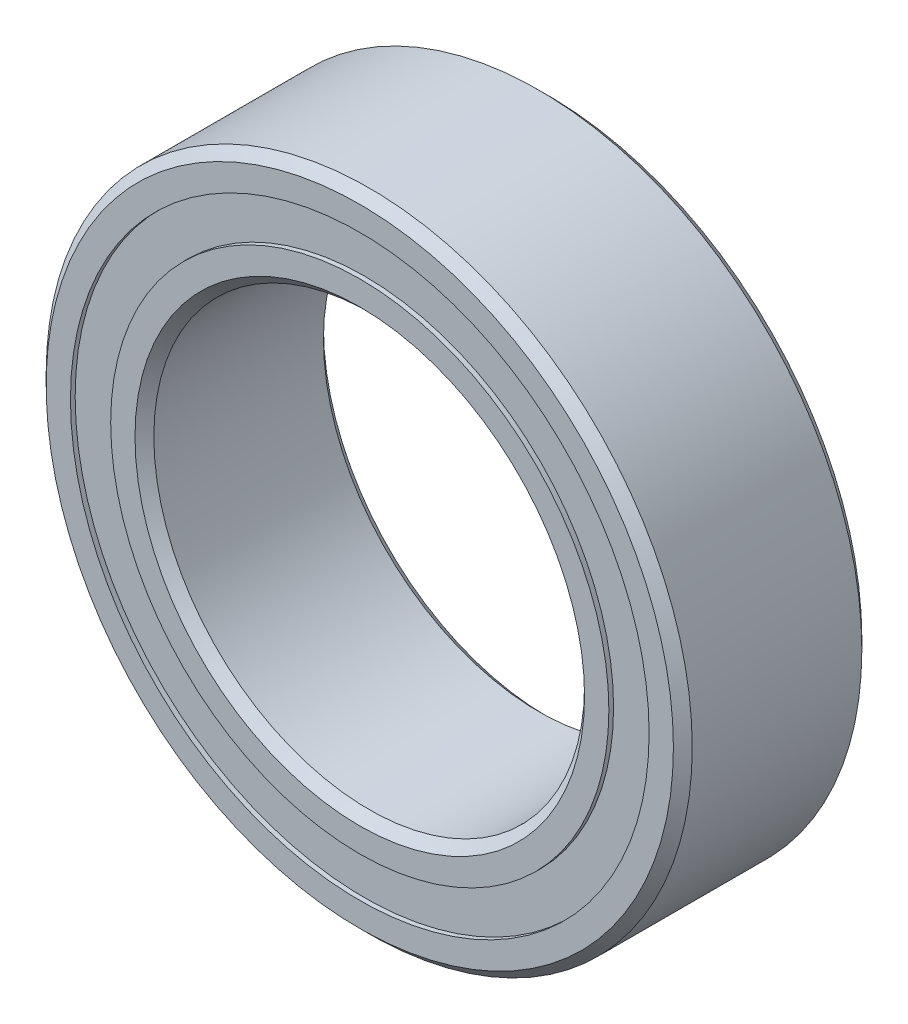
ISO-10303-21;
HEADER;
FILE_DESCRIPTION(('STEP AP214'),'2;1');
FILE_NAME('part.step','',(''),(''),'','','');
FILE_SCHEMA(('AUTOMOTIVE_DESIGN { 1 0 10303 214 1 1 1 1 }'));
ENDSEC;
DATA;
#1=APPLICATION_CONTEXT('core data for automotive mechanical design processes');
#2=APPLICATION_PROTOCOL_DEFINITION('international standard','automotive_design',2000,#1);
#3=PRODUCT_CONTEXT('',#1,'mechanical');
#4=PRODUCT('Part','Part','',(#3));
#5=PRODUCT_RELATED_PRODUCT_CATEGORY('part','',(#4));
#6=PRODUCT_DEFINITION_FORMATION('','',#4);
#7=PRODUCT_DEFINITION_CONTEXT('part definition',#1,'design');
#8=PRODUCT_DEFINITION('design','',#6,#7);
#9=PRODUCT_DEFINITION_SHAPE('','',#8);
#10=(LENGTH_UNIT() NAMED_UNIT(*) SI_UNIT(.MILLI.,.METRE.));
#11=(NAMED_UNIT(*) PLANE_ANGLE_UNIT() SI_UNIT($,.RADIAN.));
#12=(NAMED_UNIT(*) SI_UNIT($,.STERADIAN.) SOLID_ANGLE_UNIT());
#13=UNCERTAINTY_MEASURE_WITH_UNIT(LENGTH_MEASURE(1.E-05),#10,'distance_accuracy_value','');
#14=(GEOMETRIC_REPRESENTATION_CONTEXT(3) GLOBAL_UNCERTAINTY_ASSIGNED_CONTEXT((#13)) GLOBAL_UNIT_ASSIGNED_CONTEXT((#10,
#11,#12)) REPRESENTATION_CONTEXT('',''));
#15=CARTESIAN_POINT('',(0.,0.,0.));
#16=DIRECTION('',(0.,0.,1.));
#17=DIRECTION('',(1.,0.,0.));
#18=AXIS2_PLACEMENT_3D('',#15,#16,#17);
#19=CARTESIAN_POINT('',(0.,5.37362637362637,-1.6625));
#20=DIRECTION('',(0.,0.,1.));
#21=DIRECTION('',(1.,0.,0.));
#22=AXIS2_PLACEMENT_3D('',#19,#20,#21);
#23=PLANE('',#22);
#24=CARTESIAN_POINT('',(0.,0.,-1.6625));
#25=DIRECTION('',(0.,0.,1.));
#26=DIRECTION('',(1.,0.,0.));
#27=AXIS2_PLACEMENT_3D('',#24,#25,#26);
#28=CIRCLE('',#27,5.37362637362637);
#29=CARTESIAN_POINT('',(5.37362637362637,0.,-1.6625));
#30=VERTEX_POINT('',#29);
#31=EDGE_CURVE('E64',#30,#30,#28,.T.);
#32=ORIENTED_EDGE('',*,*,#31,.F.);
#33=EDGE_LOOP('',(#32));
#34=FACE_BOUND('',#33,.T.);
#35=CARTESIAN_POINT('',(0.,0.,-1.6625));
#36=DIRECTION('',(0.,0.,1.));
#37=DIRECTION('',(1.,0.,0.));
#38=AXIS2_PLACEMENT_3D('',#35,#36,#37);
#39=CIRCLE('',#38,4.62637362637363);
#40=CARTESIAN_POINT('',(4.62637362637363,0.,-1.6625));
#41=VERTEX_POINT('',#40);
#42=EDGE_CURVE('E11',#41,#41,#39,.T.);
#43=ORIENTED_EDGE('',*,*,#42,.T.);
#44=EDGE_LOOP('',(#43));
#45=FACE_BOUND('',#44,.T.);
#46=ADVANCED_FACE('F50',(#34,#45),#23,.F.);
#47=CARTESIAN_POINT('',(0.,0.,1.75));
#48=DIRECTION('',(0.,0.,1.));
#49=DIRECTION('',(1.,0.,0.));
#50=AXIS2_PLACEMENT_3D('',#47,#48,#49);
#51=CYLINDRICAL_SURFACE('',#50,4.62637362637363);
#52=ORIENTED_EDGE('',*,*,#42,.F.);
#53=EDGE_LOOP('',(#52));
#54=FACE_BOUND('',#53,.T.);
#55=CARTESIAN_POINT('',(0.,0.,-0.862864380232568));
#56=DIRECTION('',(0.,0.,1.));
#57=DIRECTION('',(1.,0.,0.));
#58=AXIS2_PLACEMENT_3D('',#55,#56,#57);
#59=CIRCLE('',#58,4.62637362637363);
#60=CARTESIAN_POINT('',(4.62637362637363,0.,-0.862864380232568));
#61=VERTEX_POINT('',#60);
#62=EDGE_CURVE('E56',#61,#61,#59,.T.);
#63=ORIENTED_EDGE('',*,*,#62,.T.);
#64=EDGE_LOOP('',(#63));
#65=FACE_BOUND('',#64,.T.);
#66=ADVANCED_FACE('F73',(#54,#65),#51,.F.);
#67=CARTESIAN_POINT('',(0.,5.37362637362637,-0.862864380232568));
#68=DIRECTION('',(0.,0.,-1.));
#69=DIRECTION('',(-1.,0.,0.));
#70=AXIS2_PLACEMENT_3D('',#67,#68,#69);
#71=PLANE('',#70);
#72=ORIENTED_EDGE('',*,*,#62,.F.);
#73=EDGE_LOOP('',(#72));
#74=FACE_BOUND('',#73,.T.);
#75=CARTESIAN_POINT('',(0.,0.,-0.862864380232568));
#76=DIRECTION('',(0.,0.,1.));
#77=DIRECTION('',(1.,0.,0.));
#78=AXIS2_PLACEMENT_3D('',#75,#76,#77);
#79=CIRCLE('',#78,5.37362637362637);
#80=CARTESIAN_POINT('',(5.37362637362637,0.,-0.862864380232568));
#81=VERTEX_POINT('',#80);
#82=EDGE_CURVE('E60',#81,#81,#79,.T.);
#83=ORIENTED_EDGE('',*,*,#82,.T.);
#84=EDGE_LOOP('',(#83));
#85=FACE_BOUND('',#84,.T.);
#86=ADVANCED_FACE('F77',(#74,#85),#71,.F.);
#87=CARTESIAN_POINT('',(0.,0.,1.75));
#88=DIRECTION('',(0.,0.,1.));
#89=DIRECTION('',(1.,0.,0.));
#90=AXIS2_PLACEMENT_3D('',#87,#88,#89);
#91=CYLINDRICAL_SURFACE('',#90,5.37362637362637);
#92=ORIENTED_EDGE('',*,*,#82,.F.);
#93=EDGE_LOOP('',(#92));
#94=FACE_BOUND('',#93,.T.);
#95=ORIENTED_EDGE('',*,*,#31,.T.);
#96=EDGE_LOOP('',(#95));
#97=FACE_BOUND('',#96,.T.);
#98=ADVANCED_FACE('F70',(#94,#97),#91,.T.);
#99=CLOSED_SHELL('',(#46,#66,#86,#98));
#100=MANIFOLD_SOLID_BREP('B2',#99);
#101=CARTESIAN_POINT('',(0.,5.37362637362637,1.6625));
#102=DIRECTION('',(0.,0.,-1.));
#103=DIRECTION('',(-1.,0.,0.));
#104=AXIS2_PLACEMENT_3D('',#101,#102,#103);
#105=PLANE('',#104);
#106=CARTESIAN_POINT('',(0.,0.,1.6625));
#107=DIRECTION('',(0.,0.,1.));
#108=DIRECTION('',(1.,0.,0.));
#109=AXIS2_PLACEMENT_3D('',#106,#107,#108);
#110=CIRCLE('',#109,4.62637362637363);
#111=CARTESIAN_POINT('',(4.62637362637363,0.,1.6625));
#112=VERTEX_POINT('',#111);
#113=EDGE_CURVE('E49',#112,#112,#110,.T.);
#114=ORIENTED_EDGE('',*,*,#113,.F.);
#115=EDGE_LOOP('',(#114));
#116=FACE_BOUND('',#115,.T.);
#117=CARTESIAN_POINT('',(0.,0.,1.6625));
#118=DIRECTION('',(0.,0.,1.));
#119=DIRECTION('',(1.,0.,0.));
#120=AXIS2_PLACEMENT_3D('',#117,#118,#119);
#121=CIRCLE('',#120,5.37362637362637);
#122=CARTESIAN_POINT('',(5.37362637362637,0.,1.6625));
#123=VERTEX_POINT('',#122);
#124=EDGE_CURVE('E124',#123,#123,#121,.T.);
#125=ORIENTED_EDGE('',*,*,#124,.T.);
#126=EDGE_LOOP('',(#125));
#127=FACE_BOUND('',#126,.T.);
#128=ADVANCED_FACE('F110',(#116,#127),#105,.F.);
#129=CARTESIAN_POINT('',(0.,0.,1.75));
#130=DIRECTION('',(0.,0.,1.));
#131=DIRECTION('',(1.,0.,0.));
#132=AXIS2_PLACEMENT_3D('',#129,#130,#131);
#133=CYLINDRICAL_SURFACE('',#132,4.62637362637363);
#134=CARTESIAN_POINT('',(0.,0.,0.862864380232567));
#135=DIRECTION('',(0.,0.,1.));
#136=DIRECTION('',(1.,0.,0.));
#137=AXIS2_PLACEMENT_3D('',#134,#135,#136);
#138=CIRCLE('',#137,4.62637362637363);
#139=CARTESIAN_POINT('',(4.62637362637363,0.,0.862864380232567));
#140=VERTEX_POINT('',#139);
#141=EDGE_CURVE('E116',#140,#140,#138,.T.);
#142=ORIENTED_EDGE('',*,*,#141,.F.);
#143=EDGE_LOOP('',(#142));
#144=FACE_BOUND('',#143,.T.);
#145=ORIENTED_EDGE('',*,*,#113,.T.);
#146=EDGE_LOOP('',(#145));
#147=FACE_BOUND('',#146,.T.);
#148=ADVANCED_FACE('F139',(#144,#147),#133,.F.);
#149=CARTESIAN_POINT('',(0.,5.37362637362637,0.862864380232568));
#150=DIRECTION('',(0.,0.,1.));
#151=DIRECTION('',(1.,0.,0.));
#152=AXIS2_PLACEMENT_3D('',#149,#150,#151);
#153=PLANE('',#152);
#154=CARTESIAN_POINT('',(0.,0.,0.862864380232568));
#155=DIRECTION('',(0.,0.,1.));
#156=DIRECTION('',(1.,0.,0.));
#157=AXIS2_PLACEMENT_3D('',#154,#155,#156);
#158=CIRCLE('',#157,5.37362637362637);
#159=CARTESIAN_POINT('',(5.37362637362637,0.,0.862864380232568));
#160=VERTEX_POINT('',#159);
#161=EDGE_CURVE('E120',#160,#160,#158,.T.);
#162=ORIENTED_EDGE('',*,*,#161,.F.);
#163=EDGE_LOOP('',(#162));
#164=FACE_BOUND('',#163,.T.);
#165=ORIENTED_EDGE('',*,*,#141,.T.);
#166=EDGE_LOOP('',(#165));
#167=FACE_BOUND('',#166,.T.);
#168=ADVANCED_FACE('F134',(#164,#167),#153,.F.);
#169=CARTESIAN_POINT('',(0.,0.,1.75));
#170=DIRECTION('',(0.,0.,1.));
#171=DIRECTION('',(1.,0.,0.));
#172=AXIS2_PLACEMENT_3D('',#169,#170,#171);
#173=CYLINDRICAL_SURFACE('',#172,5.37362637362637);
#174=ORIENTED_EDGE('',*,*,#124,.F.);
#175=EDGE_LOOP('',(#174));
#176=FACE_BOUND('',#175,.T.);
#177=ORIENTED_EDGE('',*,*,#161,.T.);
#178=EDGE_LOOP('',(#177));
#179=FACE_BOUND('',#178,.T.);
#180=ADVANCED_FACE('F131',(#176,#179),#173,.T.);
#181=CLOSED_SHELL('',(#128,#148,#168,#180));
#182=MANIFOLD_SOLID_BREP('B6',#181);
#183=CARTESIAN_POINT('',(-2.49999999999994,4.33012701892223,0.));
#184=DIRECTION('',(0.,0.,1.));
#185=DIRECTION('',(-0.499999999999989,0.866025403784445,0.));
#186=AXIS2_PLACEMENT_3D('',#183,#184,#185);
#187=SPHERICAL_SURFACE('',#186,0.862864380232568);
#188=CARTESIAN_POINT('',(-2.49999999999994,4.33012701892223,0.862864380232568));
#189=VERTEX_POINT('',#188);
#190=VERTEX_LOOP('',#189);
#191=FACE_BOUND('',#190,.T.);
#192=ADVANCED_FACE('F170',(#191),#187,.T.);
#193=CLOSED_SHELL('',(#192));
#194=MANIFOLD_SOLID_BREP('B44',#193);
#195=CARTESIAN_POINT('',(-4.33012701892216,2.50000000000005,0.));
#196=DIRECTION('',(0.,0.,1.));
#197=DIRECTION('',(-0.866025403784433,0.50000000000001,0.));
#198=AXIS2_PLACEMENT_3D('',#195,#196,#197);
#199=SPHERICAL_SURFACE('',#198,0.862864380232568);
#200=CARTESIAN_POINT('',(-4.33012701892216,2.50000000000005,0.862864380232568));
#201=VERTEX_POINT('',#200);
#202=VERTEX_LOOP('',#201);
#203=FACE_BOUND('',#202,.T.);
#204=ADVANCED_FACE('F193',(#203),#199,.T.);
#205=CLOSED_SHELL('',(#204));
#206=MANIFOLD_SOLID_BREP('B106',#205);
#207=CARTESIAN_POINT('',(-5.,0.,0.));
#208=DIRECTION('',(0.,0.,1.));
#209=DIRECTION('',(-1.,0.,0.));
#210=AXIS2_PLACEMENT_3D('',#207,#208,#209);
#211=SPHERICAL_SURFACE('',#210,0.862864380232568);
#212=CARTESIAN_POINT('',(-5.,0.,0.862864380232568));
#213=VERTEX_POINT('',#212);
#214=VERTEX_LOOP('',#213);
#215=FACE_BOUND('',#214,.T.);
#216=ADVANCED_FACE('F216',(#215),#211,.T.);
#217=CLOSED_SHELL('',(#216));
#218=MANIFOLD_SOLID_BREP('B166',#217);
#219=CARTESIAN_POINT('',(-4.33012701892222,-2.49999999999996,0.));
#220=DIRECTION('',(0.,0.,1.));
#221=DIRECTION('',(-0.866025403784443,-0.499999999999992,0.));
#222=AXIS2_PLACEMENT_3D('',#219,#220,#221);
#223=SPHERICAL_SURFACE('',#222,0.862864380232568);
#224=CARTESIAN_POINT('',(-4.33012701892222,-2.49999999999996,0.862864380232568));
#225=VERTEX_POINT('',#224);
#226=VERTEX_LOOP('',#225);
#227=FACE_BOUND('',#226,.T.);
#228=ADVANCED_FACE('F239',(#227),#223,.T.);
#229=CLOSED_SHELL('',(#228));
#230=MANIFOLD_SOLID_BREP('B189',#229);
#231=CARTESIAN_POINT('',(-2.50000000000004,-4.33012701892217,0.));
#232=DIRECTION('',(0.,0.,1.));
#233=DIRECTION('',(-0.500000000000007,-0.866025403784435,0.));
#234=AXIS2_PLACEMENT_3D('',#231,#232,#233);
#235=SPHERICAL_SURFACE('',#234,0.862864380232568);
#236=CARTESIAN_POINT('',(-2.50000000000004,-4.33012701892217,0.862864380232568));
#237=VERTEX_POINT('',#236);
#238=VERTEX_LOOP('',#237);
#239=FACE_BOUND('',#238,.T.);
#240=ADVANCED_FACE('F262',(#239),#235,.T.);
#241=CLOSED_SHELL('',(#240));
#242=MANIFOLD_SOLID_BREP('B212',#241);
#243=CARTESIAN_POINT('',(0.,-5.,0.));
#244=DIRECTION('',(0.,0.,1.));
#245=DIRECTION('',(0.,-1.,0.));
#246=AXIS2_PLACEMENT_3D('',#243,#244,#245);
#247=SPHERICAL_SURFACE('',#246,0.862864380232568);
#248=CARTESIAN_POINT('',(0.,-5.,0.862864380232568));
#249=VERTEX_POINT('',#248);
#250=VERTEX_LOOP('',#249);
#251=FACE_BOUND('',#250,.T.);
#252=ADVANCED_FACE('F285',(#251),#247,.T.);
#253=CLOSED_SHELL('',(#252));
#254=MANIFOLD_SOLID_BREP('B235',#253);
#255=CARTESIAN_POINT('',(2.49999999999997,-4.33012701892221,0.));
#256=DIRECTION('',(0.,0.,1.));
#257=DIRECTION('',(0.499999999999995,-0.866025403784442,0.));
#258=AXIS2_PLACEMENT_3D('',#255,#256,#257);
#259=SPHERICAL_SURFACE('',#258,0.862864380232568);
#260=CARTESIAN_POINT('',(2.49999999999997,-4.33012701892221,0.862864380232568));
#261=VERTEX_POINT('',#260);
#262=VERTEX_LOOP('',#261);
#263=FACE_BOUND('',#262,.T.);
#264=ADVANCED_FACE('F308',(#263),#259,.T.);
#265=CLOSED_SHELL('',(#264));
#266=MANIFOLD_SOLID_BREP('B258',#265);
#267=CARTESIAN_POINT('',(4.33012701892218,-2.50000000000002,0.));
#268=DIRECTION('',(0.,0.,1.));
#269=DIRECTION('',(0.866025403784436,-0.500000000000004,0.));
#270=AXIS2_PLACEMENT_3D('',#267,#268,#269);
#271=SPHERICAL_SURFACE('',#270,0.862864380232568);
#272=CARTESIAN_POINT('',(4.33012701892218,-2.50000000000002,0.862864380232568));
#273=VERTEX_POINT('',#272);
#274=VERTEX_LOOP('',#273);
#275=FACE_BOUND('',#274,.T.);
#276=ADVANCED_FACE('F331',(#275),#271,.T.);
#277=CLOSED_SHELL('',(#276));
#278=MANIFOLD_SOLID_BREP('B281',#277);
#279=CARTESIAN_POINT('',(5.,0.,0.));
#280=DIRECTION('',(0.,0.,1.));
#281=DIRECTION('',(1.,0.,0.));
#282=AXIS2_PLACEMENT_3D('',#279,#280,#281);
#283=SPHERICAL_SURFACE('',#282,0.862864380232568);
#284=CARTESIAN_POINT('',(5.,0.,0.862864380232568));
#285=VERTEX_POINT('',#284);
#286=VERTEX_LOOP('',#285);
#287=FACE_BOUND('',#286,.T.);
#288=ADVANCED_FACE('F354',(#287),#283,.T.);
#289=CLOSED_SHELL('',(#288));
#290=MANIFOLD_SOLID_BREP('B304',#289);
#291=CARTESIAN_POINT('',(4.3301270189222,2.49999999999999,0.));
#292=DIRECTION('',(0.,0.,1.));
#293=DIRECTION('',(0.86602540378444,0.499999999999998,0.));
#294=AXIS2_PLACEMENT_3D('',#291,#292,#293);
#295=SPHERICAL_SURFACE('',#294,0.862864380232568);
#296=CARTESIAN_POINT('',(4.3301270189222,2.49999999999999,0.862864380232568));
#297=VERTEX_POINT('',#296);
#298=VERTEX_LOOP('',#297);
#299=FACE_BOUND('',#298,.T.);
#300=ADVANCED_FACE('F377',(#299),#295,.T.);
#301=CLOSED_SHELL('',(#300));
#302=MANIFOLD_SOLID_BREP('B327',#301);
#303=CARTESIAN_POINT('',(2.50000000000001,4.33012701892219,0.));
#304=DIRECTION('',(0.,0.,1.));
#305=DIRECTION('',(0.500000000000001,0.866025403784438,0.));
#306=AXIS2_PLACEMENT_3D('',#303,#304,#305);
#307=SPHERICAL_SURFACE('',#306,0.862864380232568);
#308=CARTESIAN_POINT('',(2.50000000000001,4.33012701892219,0.862864380232568));
#309=VERTEX_POINT('',#308);
#310=VERTEX_LOOP('',#309);
#311=FACE_BOUND('',#310,.T.);
#312=ADVANCED_FACE('F400',(#311),#307,.T.);
#313=CLOSED_SHELL('',(#312));
#314=MANIFOLD_SOLID_BREP('B350',#313);
#315=CARTESIAN_POINT('',(0.,5.,0.));
#316=DIRECTION('',(0.,0.,1.));
#317=DIRECTION('',(0.,1.,0.));
#318=AXIS2_PLACEMENT_3D('',#315,#316,#317);
#319=SPHERICAL_SURFACE('',#318,0.862864380232568);
#320=CARTESIAN_POINT('',(0.,5.,0.862864380232568));
#321=VERTEX_POINT('',#320);
#322=VERTEX_LOOP('',#321);
#323=FACE_BOUND('',#322,.T.);
#324=ADVANCED_FACE('F425',(#323),#319,.T.);
#325=CLOSED_SHELL('',(#324));
#326=MANIFOLD_SOLID_BREP('B373',#325);
#327=CARTESIAN_POINT('',(0.,4.62637362637363,1.75));
#328=DIRECTION('',(0.,0.,-1.));
#329=DIRECTION('',(-1.,0.,0.));
#330=AXIS2_PLACEMENT_3D('',#327,#328,#329);
#331=PLANE('',#330);
#332=CARTESIAN_POINT('',(0.,0.,1.75));
#333=DIRECTION('',(0.,0.,1.));
#334=DIRECTION('',(1.,0.,0.));
#335=AXIS2_PLACEMENT_3D('',#332,#333,#334);
#336=CIRCLE('',#335,4.175);
#337=CARTESIAN_POINT('',(4.175,0.,1.75));
#338=VERTEX_POINT('',#337);
#339=EDGE_CURVE('E471',#338,#338,#336,.T.);
#340=ORIENTED_EDGE('',*,*,#339,.F.);
#341=EDGE_LOOP('',(#340));
#342=FACE_BOUND('',#341,.T.);
#343=CARTESIAN_POINT('',(0.,0.,1.75));
#344=DIRECTION('',(0.,0.,1.));
#345=DIRECTION('',(1.,0.,0.));
#346=AXIS2_PLACEMENT_3D('',#343,#344,#345);
#347=CIRCLE('',#346,4.62637362637363);
#348=CARTESIAN_POINT('',(4.62637362637363,0.,1.75));
#349=VERTEX_POINT('',#348);
#350=EDGE_CURVE('E424',#349,#349,#347,.T.);
#351=ORIENTED_EDGE('',*,*,#350,.T.);
#352=EDGE_LOOP('',(#351));
#353=FACE_BOUND('',#352,.T.);
#354=ADVANCED_FACE('F443',(#342,#353),#331,.F.);
#355=CARTESIAN_POINT('',(0.,0.,1.75));
#356=DIRECTION('',(0.,0.,1.));
#357=DIRECTION('',(1.,0.,0.));
#358=AXIS2_PLACEMENT_3D('',#355,#356,#357);
#359=CYLINDRICAL_SURFACE('',#358,4.62637362637363);
#360=ORIENTED_EDGE('',*,*,#350,.F.);
#361=EDGE_LOOP('',(#360));
#362=FACE_BOUND('',#361,.T.);
#363=CARTESIAN_POINT('',(0.,0.,0.777777777777778));
#364=DIRECTION('',(0.,0.,1.));
#365=DIRECTION('',(1.,0.,0.));
#366=AXIS2_PLACEMENT_3D('',#363,#364,#365);
#367=CIRCLE('',#366,4.62637362637363);
#368=CARTESIAN_POINT('',(4.62637362637363,0.,0.777777777777778));
#369=VERTEX_POINT('',#368);
#370=EDGE_CURVE('E449',#369,#369,#367,.T.);
#371=ORIENTED_EDGE('',*,*,#370,.T.);
#372=EDGE_LOOP('',(#371));
#373=FACE_BOUND('',#372,.T.);
#374=ADVANCED_FACE('F478',(#362,#373),#359,.T.);
#375=CARTESIAN_POINT('',(0.,0.,0.));
#376=DIRECTION('',(0.,0.,1.));
#377=DIRECTION('',(1.,0.,0.));
#378=AXIS2_PLACEMENT_3D('',#375,#376,#377);
#379=TOROIDAL_SURFACE('',#378,5.,0.862864380232566);
#380=ORIENTED_EDGE('',*,*,#370,.F.);
#381=EDGE_LOOP('',(#380));
#382=FACE_BOUND('',#381,.T.);
#383=CARTESIAN_POINT('',(0.,0.,-0.777777777777779));
#384=DIRECTION('',(0.,0.,1.));
#385=DIRECTION('',(1.,0.,0.));
#386=AXIS2_PLACEMENT_3D('',#383,#384,#385);
#387=CIRCLE('',#386,4.62637362637363);
#388=CARTESIAN_POINT('',(4.62637362637363,0.,-0.777777777777779));
#389=VERTEX_POINT('',#388);
#390=EDGE_CURVE('E453',#389,#389,#387,.T.);
#391=ORIENTED_EDGE('',*,*,#390,.T.);
#392=EDGE_LOOP('',(#391));
#393=FACE_BOUND('',#392,.T.);
#394=ADVANCED_FACE('F482',(#382,#393),#379,.F.);
#395=CARTESIAN_POINT('',(0.,0.,1.75));
#396=DIRECTION('',(0.,0.,1.));
#397=DIRECTION('',(1.,0.,0.));
#398=AXIS2_PLACEMENT_3D('',#395,#396,#397);
#399=CYLINDRICAL_SURFACE('',#398,4.62637362637363);
#400=ORIENTED_EDGE('',*,*,#390,.F.);
#401=EDGE_LOOP('',(#400));
#402=FACE_BOUND('',#401,.T.);
#403=CARTESIAN_POINT('',(0.,0.,-1.75));
#404=DIRECTION('',(0.,0.,1.));
#405=DIRECTION('',(1.,0.,0.));
#406=AXIS2_PLACEMENT_3D('',#403,#404,#405);
#407=CIRCLE('',#406,4.62637362637363);
#408=CARTESIAN_POINT('',(4.62637362637363,0.,-1.75));
#409=VERTEX_POINT('',#408);
#410=EDGE_CURVE('E457',#409,#409,#407,.T.);
#411=ORIENTED_EDGE('',*,*,#410,.T.);
#412=EDGE_LOOP('',(#411));
#413=FACE_BOUND('',#412,.T.);
#414=ADVANCED_FACE('F487',(#402,#413),#399,.T.);
#415=CARTESIAN_POINT('',(0.,4.175,-1.75));
#416=DIRECTION('',(0.,0.,1.));
#417=DIRECTION('',(1.,0.,0.));
#418=AXIS2_PLACEMENT_3D('',#415,#416,#417);
#419=PLANE('',#418);
#420=ORIENTED_EDGE('',*,*,#410,.F.);
#421=EDGE_LOOP('',(#420));
#422=FACE_BOUND('',#421,.T.);
#423=CARTESIAN_POINT('',(0.,0.,-1.75));
#424=DIRECTION('',(0.,0.,1.));
#425=DIRECTION('',(1.,0.,0.));
#426=AXIS2_PLACEMENT_3D('',#423,#424,#425);
#427=CIRCLE('',#426,4.175);
#428=CARTESIAN_POINT('',(4.175,0.,-1.75));
#429=VERTEX_POINT('',#428);
#430=EDGE_CURVE('E462',#429,#429,#427,.T.);
#431=ORIENTED_EDGE('',*,*,#430,.T.);
#432=EDGE_LOOP('',(#431));
#433=FACE_BOUND('',#432,.T.);
#434=ADVANCED_FACE('F493',(#422,#433),#419,.F.);
#435=CARTESIAN_POINT('',(0.,0.,-1.575));
#436=DIRECTION('',(0.,0.,-1.));
#437=DIRECTION('',(-1.,0.,0.));
#438=AXIS2_PLACEMENT_3D('',#435,#436,#437);
#439=CONICAL_SURFACE('',#438,4.,0.785398163397447);
#440=ORIENTED_EDGE('',*,*,#430,.F.);
#441=EDGE_LOOP('',(#440));
#442=FACE_BOUND('',#441,.T.);
#443=CARTESIAN_POINT('',(0.,0.,-1.575));
#444=DIRECTION('',(0.,0.,1.));
#445=DIRECTION('',(1.,0.,0.));
#446=AXIS2_PLACEMENT_3D('',#443,#444,#445);
#447=CIRCLE('',#446,4.);
#448=CARTESIAN_POINT('',(4.,0.,-1.575));
#449=VERTEX_POINT('',#448);
#450=EDGE_CURVE('E465',#449,#449,#447,.T.);
#451=ORIENTED_EDGE('',*,*,#450,.T.);
#452=EDGE_LOOP('',(#451));
#453=FACE_BOUND('',#452,.T.);
#454=ADVANCED_FACE('F497',(#442,#453),#439,.F.);
#455=CARTESIAN_POINT('',(0.,0.,1.75));
#456=DIRECTION('',(0.,0.,1.));
#457=DIRECTION('',(1.,0.,0.));
#458=AXIS2_PLACEMENT_3D('',#455,#456,#457);
#459=CYLINDRICAL_SURFACE('',#458,4.);
#460=ORIENTED_EDGE('',*,*,#450,.F.);
#461=EDGE_LOOP('',(#460));
#462=FACE_BOUND('',#461,.T.);
#463=CARTESIAN_POINT('',(0.,0.,1.575));
#464=DIRECTION('',(0.,0.,1.));
#465=DIRECTION('',(1.,0.,0.));
#466=AXIS2_PLACEMENT_3D('',#463,#464,#465);
#467=CIRCLE('',#466,4.);
#468=CARTESIAN_POINT('',(4.,0.,1.575));
#469=VERTEX_POINT('',#468);
#470=EDGE_CURVE('E468',#469,#469,#467,.T.);
#471=ORIENTED_EDGE('',*,*,#470,.T.);
#472=EDGE_LOOP('',(#471));
#473=FACE_BOUND('',#472,.T.);
#474=ADVANCED_FACE('F501',(#462,#473),#459,.F.);
#475=CARTESIAN_POINT('',(0.,0.,1.75));
#476=DIRECTION('',(0.,0.,1.));
#477=DIRECTION('',(1.,0.,0.));
#478=AXIS2_PLACEMENT_3D('',#475,#476,#477);
#479=CONICAL_SURFACE('',#478,4.175,0.785398163397448);
#480=ORIENTED_EDGE('',*,*,#470,.F.);
#481=EDGE_LOOP('',(#480));
#482=FACE_BOUND('',#481,.T.);
#483=ORIENTED_EDGE('',*,*,#339,.T.);
#484=EDGE_LOOP('',(#483));
#485=FACE_BOUND('',#484,.T.);
#486=ADVANCED_FACE('F475',(#482,#485),#479,.F.);
#487=CLOSED_SHELL('',(#354,#374,#394,#414,#434,#454,#474,#486));
#488=MANIFOLD_SOLID_BREP('B396',#487);
#489=CARTESIAN_POINT('',(0.,0.,1.575));
#490=DIRECTION('',(0.,0.,-1.));
#491=DIRECTION('',(-1.,0.,0.));
#492=AXIS2_PLACEMENT_3D('',#489,#490,#491);
#493=CONICAL_SURFACE('',#492,6.,0.785398163397448);
#494=CARTESIAN_POINT('',(0.,0.,1.75));
#495=DIRECTION('',(0.,0.,1.));
#496=DIRECTION('',(1.,0.,0.));
#497=AXIS2_PLACEMENT_3D('',#494,#495,#496);
#498=CIRCLE('',#497,5.825);
#499=CARTESIAN_POINT('',(5.825,0.,1.75));
#500=VERTEX_POINT('',#499);
#501=EDGE_CURVE('E577',#500,#500,#498,.T.);
#502=ORIENTED_EDGE('',*,*,#501,.F.);
#503=EDGE_LOOP('',(#502));
#504=FACE_BOUND('',#503,.T.);
#505=CARTESIAN_POINT('',(0.,0.,1.575));
#506=DIRECTION('',(0.,0.,1.));
#507=DIRECTION('',(1.,0.,0.));
#508=AXIS2_PLACEMENT_3D('',#505,#506,#507);
#509=CIRCLE('',#508,6.);
#510=CARTESIAN_POINT('',(6.,0.,1.575));
#511=VERTEX_POINT('',#510);
#512=EDGE_CURVE('E442',#511,#511,#509,.T.);
#513=ORIENTED_EDGE('',*,*,#512,.T.);
#514=EDGE_LOOP('',(#513));
#515=FACE_BOUND('',#514,.T.);
#516=ADVANCED_FACE('F549',(#504,#515),#493,.T.);
#517=CARTESIAN_POINT('',(0.,0.,1.75));
#518=DIRECTION('',(0.,0.,1.));
#519=DIRECTION('',(1.,0.,0.));
#520=AXIS2_PLACEMENT_3D('',#517,#518,#519);
#521=CYLINDRICAL_SURFACE('',#520,6.);
#522=ORIENTED_EDGE('',*,*,#512,.F.);
#523=EDGE_LOOP('',(#522));
#524=FACE_BOUND('',#523,.T.);
#525=CARTESIAN_POINT('',(0.,0.,-1.575));
#526=DIRECTION('',(0.,0.,1.));
#527=DIRECTION('',(1.,0.,0.));
#528=AXIS2_PLACEMENT_3D('',#525,#526,#527);
#529=CIRCLE('',#528,6.);
#530=CARTESIAN_POINT('',(6.,0.,-1.575));
#531=VERTEX_POINT('',#530);
#532=EDGE_CURVE('E555',#531,#531,#529,.T.);
#533=ORIENTED_EDGE('',*,*,#532,.T.);
#534=EDGE_LOOP('',(#533));
#535=FACE_BOUND('',#534,.T.);
#536=ADVANCED_FACE('F584',(#524,#535),#521,.T.);
#537=CARTESIAN_POINT('',(0.,0.,-1.75));
#538=DIRECTION('',(0.,0.,1.));
#539=DIRECTION('',(1.,0.,0.));
#540=AXIS2_PLACEMENT_3D('',#537,#538,#539);
#541=CONICAL_SURFACE('',#540,5.825,0.785398163397447);
#542=ORIENTED_EDGE('',*,*,#532,.F.);
#543=EDGE_LOOP('',(#542));
#544=FACE_BOUND('',#543,.T.);
#545=CARTESIAN_POINT('',(0.,0.,-1.75));
#546=DIRECTION('',(0.,0.,1.));
#547=DIRECTION('',(1.,0.,0.));
#548=AXIS2_PLACEMENT_3D('',#545,#546,#547);
#549=CIRCLE('',#548,5.825);
#550=CARTESIAN_POINT('',(5.825,0.,-1.75));
#551=VERTEX_POINT('',#550);
#552=EDGE_CURVE('E559',#551,#551,#549,.T.);
#553=ORIENTED_EDGE('',*,*,#552,.T.);
#554=EDGE_LOOP('',(#553));
#555=FACE_BOUND('',#554,.T.);
#556=ADVANCED_FACE('F588',(#544,#555),#541,.T.);
#557=CARTESIAN_POINT('',(0.,5.825,-1.75));
#558=DIRECTION('',(0.,0.,1.));
#559=DIRECTION('',(1.,0.,0.));
#560=AXIS2_PLACEMENT_3D('',#557,#558,#559);
#561=PLANE('',#560);
#562=ORIENTED_EDGE('',*,*,#552,.F.);
#563=EDGE_LOOP('',(#562));
#564=FACE_BOUND('',#563,.T.);
#565=CARTESIAN_POINT('',(0.,0.,-1.75));
#566=DIRECTION('',(0.,0.,1.));
#567=DIRECTION('',(1.,0.,0.));
#568=AXIS2_PLACEMENT_3D('',#565,#566,#567);
#569=CIRCLE('',#568,5.37362637362637);
#570=CARTESIAN_POINT('',(5.37362637362637,0.,-1.75));
#571=VERTEX_POINT('',#570);
#572=EDGE_CURVE('E563',#571,#571,#569,.T.);
#573=ORIENTED_EDGE('',*,*,#572,.T.);
#574=EDGE_LOOP('',(#573));
#575=FACE_BOUND('',#574,.T.);
#576=ADVANCED_FACE('F593',(#564,#575),#561,.F.);
#577=CARTESIAN_POINT('',(0.,0.,1.75));
#578=DIRECTION('',(0.,0.,1.));
#579=DIRECTION('',(1.,0.,0.));
#580=AXIS2_PLACEMENT_3D('',#577,#578,#579);
#581=CYLINDRICAL_SURFACE('',#580,5.37362637362637);
#582=ORIENTED_EDGE('',*,*,#572,.F.);
#583=EDGE_LOOP('',(#582));
#584=FACE_BOUND('',#583,.T.);
#585=CARTESIAN_POINT('',(0.,0.,-0.777777777777778));
#586=DIRECTION('',(0.,0.,1.));
#587=DIRECTION('',(1.,0.,0.));
#588=AXIS2_PLACEMENT_3D('',#585,#586,#587);
#589=CIRCLE('',#588,5.37362637362637);
#590=CARTESIAN_POINT('',(5.37362637362637,0.,-0.777777777777778));
#591=VERTEX_POINT('',#590);
#592=EDGE_CURVE('E568',#591,#591,#589,.T.);
#593=ORIENTED_EDGE('',*,*,#592,.T.);
#594=EDGE_LOOP('',(#593));
#595=FACE_BOUND('',#594,.T.);
#596=ADVANCED_FACE('F599',(#584,#595),#581,.F.);
#597=CARTESIAN_POINT('',(0.,0.,0.));
#598=DIRECTION('',(0.,0.,1.));
#599=DIRECTION('',(1.,0.,0.));
#600=AXIS2_PLACEMENT_3D('',#597,#598,#599);
#601=TOROIDAL_SURFACE('',#600,5.,0.862864380232568);
#602=ORIENTED_EDGE('',*,*,#592,.F.);
#603=EDGE_LOOP('',(#602));
#604=FACE_BOUND('',#603,.T.);
#605=CARTESIAN_POINT('',(0.,0.,0.777777777777778));
#606=DIRECTION('',(0.,0.,1.));
#607=DIRECTION('',(1.,0.,0.));
#608=AXIS2_PLACEMENT_3D('',#605,#606,#607);
#609=CIRCLE('',#608,5.37362637362637);
#610=CARTESIAN_POINT('',(5.37362637362637,0.,0.777777777777778));
#611=VERTEX_POINT('',#610);
#612=EDGE_CURVE('E571',#611,#611,#609,.T.);
#613=ORIENTED_EDGE('',*,*,#612,.T.);
#614=EDGE_LOOP('',(#613));
#615=FACE_BOUND('',#614,.T.);
#616=ADVANCED_FACE('F603',(#604,#615),#601,.F.);
#617=CARTESIAN_POINT('',(0.,0.,1.75));
#618=DIRECTION('',(0.,0.,1.));
#619=DIRECTION('',(1.,0.,0.));
#620=AXIS2_PLACEMENT_3D('',#617,#618,#619);
#621=CYLINDRICAL_SURFACE('',#620,5.37362637362637);
#622=ORIENTED_EDGE('',*,*,#612,.F.);
#623=EDGE_LOOP('',(#622));
#624=FACE_BOUND('',#623,.T.);
#625=CARTESIAN_POINT('',(0.,0.,1.75));
#626=DIRECTION('',(0.,0.,1.));
#627=DIRECTION('',(1.,0.,0.));
#628=AXIS2_PLACEMENT_3D('',#625,#626,#627);
#629=CIRCLE('',#628,5.37362637362637);
#630=CARTESIAN_POINT('',(5.37362637362637,0.,1.75));
#631=VERTEX_POINT('',#630);
#632=EDGE_CURVE('E574',#631,#631,#629,.T.);
#633=ORIENTED_EDGE('',*,*,#632,.T.);
#634=EDGE_LOOP('',(#633));
#635=FACE_BOUND('',#634,.T.);
#636=ADVANCED_FACE('F607',(#624,#635),#621,.F.);
#637=CARTESIAN_POINT('',(0.,5.825,1.75));
#638=DIRECTION('',(0.,0.,-1.));
#639=DIRECTION('',(-1.,0.,0.));
#640=AXIS2_PLACEMENT_3D('',#637,#638,#639);
#641=PLANE('',#640);
#642=ORIENTED_EDGE('',*,*,#632,.F.);
#643=EDGE_LOOP('',(#642));
#644=FACE_BOUND('',#643,.T.);
#645=ORIENTED_EDGE('',*,*,#501,.T.);
#646=EDGE_LOOP('',(#645));
#647=FACE_BOUND('',#646,.T.);
#648=ADVANCED_FACE('F581',(#644,#647),#641,.F.);
#649=CLOSED_SHELL('',(#516,#536,#556,#576,#596,#616,#636,#648));
#650=MANIFOLD_SOLID_BREP('B419',#649);
#651=ADVANCED_BREP_SHAPE_REPRESENTATION('',(#18,#100,#182,#194,#206,#218,#230,#242,#254,#266,
#278,#290,#302,#314,#326,#488,#650),#14);
#652=SHAPE_DEFINITION_REPRESENTATION(#9,#651);
ENDSEC;
END-ISO-10303-21;
